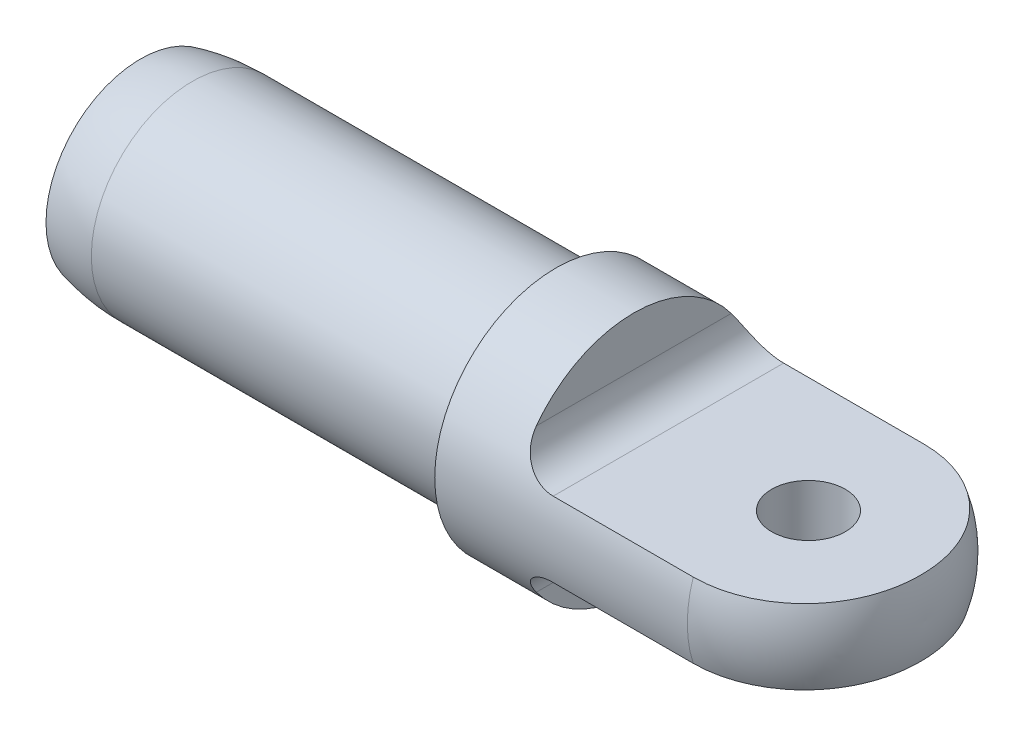
ISO-10303-21;
HEADER;
FILE_DESCRIPTION(('STEP AP214'),'2;1');
FILE_NAME('part.step','',(''),(''),'','','');
FILE_SCHEMA(('AUTOMOTIVE_DESIGN { 1 0 10303 214 1 1 1 1 }'));
ENDSEC;
DATA;
#1=APPLICATION_CONTEXT('core data for automotive mechanical design processes');
#2=APPLICATION_PROTOCOL_DEFINITION('international standard','automotive_design',2000,#1);
#3=PRODUCT_CONTEXT('',#1,'mechanical');
#4=PRODUCT('Part','Part','',(#3));
#5=PRODUCT_RELATED_PRODUCT_CATEGORY('part','',(#4));
#6=PRODUCT_DEFINITION_FORMATION('','',#4);
#7=PRODUCT_DEFINITION_CONTEXT('part definition',#1,'design');
#8=PRODUCT_DEFINITION('design','',#6,#7);
#9=PRODUCT_DEFINITION_SHAPE('','',#8);
#10=(LENGTH_UNIT() NAMED_UNIT(*) SI_UNIT(.MILLI.,.METRE.));
#11=(NAMED_UNIT(*) PLANE_ANGLE_UNIT() SI_UNIT($,.RADIAN.));
#12=(NAMED_UNIT(*) SI_UNIT($,.STERADIAN.) SOLID_ANGLE_UNIT());
#13=UNCERTAINTY_MEASURE_WITH_UNIT(LENGTH_MEASURE(1.E-05),#10,'distance_accuracy_value','');
#14=(GEOMETRIC_REPRESENTATION_CONTEXT(3) GLOBAL_UNCERTAINTY_ASSIGNED_CONTEXT((#13)) GLOBAL_UNIT_ASSIGNED_CONTEXT((#10,
#11,#12)) REPRESENTATION_CONTEXT('',''));
#15=CARTESIAN_POINT('',(0.,0.,0.));
#16=DIRECTION('',(0.,0.,1.));
#17=DIRECTION('',(1.,0.,0.));
#18=AXIS2_PLACEMENT_3D('',#15,#16,#17);
#19=CARTESIAN_POINT('',(4.11479999999999,-3.429,0.));
#20=DIRECTION('',(0.,-1.,0.));
#21=DIRECTION('',(0.,0.,-1.));
#22=AXIS2_PLACEMENT_3D('',#19,#20,#21);
#23=CYLINDRICAL_SURFACE('',#22,3.37819999999999);
#24=CARTESIAN_POINT('',(4.11479999999999,3.429,0.));
#25=DIRECTION('',(0.,-1.,0.));
#26=DIRECTION('',(0.,0.,-1.));
#27=AXIS2_PLACEMENT_3D('',#24,#25,#26);
#28=CIRCLE('',#27,3.37819999999999);
#29=CARTESIAN_POINT('',(4.11479999999999,3.429,-3.37819999999999));
#30=VERTEX_POINT('',#29);
#31=EDGE_CURVE('E19',#30,#30,#28,.T.);
#32=ORIENTED_EDGE('',*,*,#31,.F.);
#33=EDGE_LOOP('',(#32));
#34=FACE_BOUND('',#33,.T.);
#35=CARTESIAN_POINT('',(4.11479999999999,-3.429,0.));
#36=DIRECTION('',(0.,-1.,0.));
#37=DIRECTION('',(0.,0.,-1.));
#38=AXIS2_PLACEMENT_3D('',#35,#36,#37);
#39=CIRCLE('',#38,3.37819999999999);
#40=CARTESIAN_POINT('',(4.11479999999999,-3.429,-3.37819999999999));
#41=VERTEX_POINT('',#40);
#42=EDGE_CURVE('E177',#41,#41,#39,.T.);
#43=ORIENTED_EDGE('',*,*,#42,.T.);
#44=EDGE_LOOP('',(#43));
#45=FACE_BOUND('',#44,.T.);
#46=ADVANCED_FACE('F16',(#34,#45),#23,.F.);
#47=CARTESIAN_POINT('',(-17.5305929065692,0.,0.));
#48=DIRECTION('',(-1.,0.,0.));
#49=DIRECTION('',(0.,0.,1.));
#50=AXIS2_PLACEMENT_3D('',#47,#48,#49);
#51=CONICAL_SURFACE('',#50,6.34999999999985,1.17809724509603);
#52=CARTESIAN_POINT('',(-14.9003367854998,-2.88657986402541E-12,0.));
#53=VERTEX_POINT('',#52);
#54=VERTEX_LOOP('',#53);
#55=FACE_BOUND('',#54,.T.);
#56=CARTESIAN_POINT('',(-17.5305929065692,0.,0.));
#57=DIRECTION('',(1.,0.,0.));
#58=DIRECTION('',(0.,1.,0.));
#59=AXIS2_PLACEMENT_3D('',#56,#57,#58);
#60=CIRCLE('',#59,6.35);
#61=CARTESIAN_POINT('',(-17.5305929065692,6.35,0.));
#62=VERTEX_POINT('',#61);
#63=EDGE_CURVE('E102',#62,#62,#60,.F.);
#64=ORIENTED_EDGE('',*,*,#63,.T.);
#65=EDGE_LOOP('',(#64));
#66=FACE_BOUND('',#65,.T.);
#67=ADVANCED_FACE('F317',(#55,#66),#51,.F.);
#68=CARTESIAN_POINT('',(-11.90625,0.,-25.4));
#69=DIRECTION('',(-1.,0.,0.));
#70=DIRECTION('',(0.,-1.,0.));
#71=AXIS2_PLACEMENT_3D('',#68,#69,#70);
#72=PLANE('',#71);
#73=CARTESIAN_POINT('',(-11.90625,0.,0.));
#74=DIRECTION('',(-1.,0.,0.));
#75=DIRECTION('',(0.,0.,1.));
#76=AXIS2_PLACEMENT_3D('',#73,#74,#75);
#77=CIRCLE('',#76,11.1125);
#78=CARTESIAN_POINT('',(-11.90625,6.604,8.9372725285738));
#79=VERTEX_POINT('',#78);
#80=CARTESIAN_POINT('',(-11.90625,6.604,-8.93727252857381));
#81=VERTEX_POINT('',#80);
#82=EDGE_CURVE('E93',#79,#81,#77,.T.);
#83=ORIENTED_EDGE('',*,*,#82,.F.);
#84=DIRECTION('',(0.,0.,1.));
#85=VECTOR('',#84,1.);
#86=CARTESIAN_POINT('',(-11.90625,6.604,-25.4));
#87=LINE('',#86,#85);
#88=EDGE_CURVE('E82',#79,#81,#87,.F.);
#89=ORIENTED_EDGE('',*,*,#88,.T.);
#90=EDGE_LOOP('',(#83,#89));
#91=FACE_BOUND('',#90,.T.);
#92=ADVANCED_FACE('F94',(#91),#72,.F.);
#93=CARTESIAN_POINT('',(-8.73125,6.604,-25.4));
#94=DIRECTION('',(0.,0.,1.));
#95=DIRECTION('',(1.,0.,0.));
#96=AXIS2_PLACEMENT_3D('',#93,#94,#95);
#97=CYLINDRICAL_SURFACE('',#96,3.175);
#98=ORIENTED_EDGE('',*,*,#88,.F.);
#99=CARTESIAN_POINT('',(-8.73125,3.429,10.5702230463695));
#100=CARTESIAN_POINT('',(-8.81644137209209,3.42898964334418,10.57021868882));
#101=CARTESIAN_POINT('',(-8.90162878420486,3.43242866255951,10.5691105793098));
#102=CARTESIAN_POINT('',(-9.0713896064465,3.44612657704858,10.5646563075687));
#103=CARTESIAN_POINT('',(-9.15596305347103,3.45638505902536,10.5613102809678));
#104=CARTESIAN_POINT('',(-9.32379771113513,3.48362638431548,10.5523551088256));
#105=CARTESIAN_POINT('',(-9.40706039921373,3.50060099405158,10.5467487341787));
#106=CARTESIAN_POINT('',(-9.57176089589968,3.54109786752571,10.5332204817785));
#107=CARTESIAN_POINT('',(-9.65319872625449,3.56462005318909,10.5252986316354));
#108=CARTESIAN_POINT('',(-9.8939837350312,3.64474053089436,10.4979406966834));
#109=CARTESIAN_POINT('',(-10.0498768159816,3.7109049645627,10.474908439963));
#110=CARTESIAN_POINT('',(-10.3476724829089,3.86611060939245,10.4186183087708));
#111=CARTESIAN_POINT('',(-10.4895761541552,3.95515004402298,10.3853612283454));
#112=CARTESIAN_POINT('',(-10.7565227077505,4.15315582749193,10.3077777511883));
#113=CARTESIAN_POINT('',(-10.8814738286125,4.26222364591995,10.2633945480904));
#114=CARTESIAN_POINT('',(-11.110768665047,4.49561535291995,10.1633252352251));
#115=CARTESIAN_POINT('',(-11.2151178279965,4.61993519456048,10.107642121192));
#116=CARTESIAN_POINT('',(-11.4047626615352,4.88347906309568,9.98304636726048));
#117=CARTESIAN_POINT('',(-11.4893072870739,5.02306175922409,9.91375461873637));
#118=CARTESIAN_POINT('',(-11.6344640664801,5.30874166212583,9.76375698694889));
#119=CARTESIAN_POINT('',(-11.6950323763681,5.45485026464855,9.68303055633474));
#120=CARTESIAN_POINT('',(-11.7719425009657,5.68600082097612,9.54812194128914));
#121=CARTESIAN_POINT('',(-11.7961297811925,5.77051344099837,9.49730080886649));
#122=CARTESIAN_POINT('',(-11.8371428820053,5.9394662870258,9.39256419221462));
#123=CARTESIAN_POINT('',(-11.8539661502908,6.02390647782363,9.33864764245365));
#124=CARTESIAN_POINT('',(-11.8805140341432,6.19174044666473,9.22822057458625));
#125=CARTESIAN_POINT('',(-11.8902639069898,6.27513689242123,9.17172005940878));
#126=CARTESIAN_POINT('',(-11.9031297535498,6.44063808479297,9.05627192122752));
#127=CARTESIAN_POINT('',(-11.9062513840634,6.52274387344697,8.99732642870738));
#128=CARTESIAN_POINT('',(-11.90625,6.604,8.9372725285738));
#129=B_SPLINE_CURVE_WITH_KNOTS('',3,(#99,#100,#101,#102,#103,#104,#105,#106,#107,#108,#109,#110,
#111,#112,#113,#114,#115,#116,#117,#118,#119,#120,#121,#122,#123,#124,#125,#126,#127,#128),
.UNSPECIFIED.,.F.,.F.,(4,2,2,2,2,2,2,2,2,2,2,2,2,2,4),(0.,0.255490424414822,0.51096536611527,
0.766128076222038,1.0212877438465,1.53138350863043,2.04143967004604,2.55415502982541,
3.06673464010963,3.59639994424521,4.12702938859439,4.43137229256887,4.73582059570047,
5.03917636850782,5.34227314145619),.UNSPECIFIED.);
#130=CARTESIAN_POINT('',(-8.73125,3.429,10.5702230463695));
#131=VERTEX_POINT('',#130);
#132=EDGE_CURVE('E88',#131,#79,#129,.T.);
#133=ORIENTED_EDGE('',*,*,#132,.F.);
#134=DIRECTION('',(0.,0.,1.));
#135=VECTOR('',#134,1.);
#136=CARTESIAN_POINT('',(-8.73125,3.429,-25.4));
#137=LINE('',#136,#135);
#138=CARTESIAN_POINT('',(-8.73125,3.429,-10.5702230463695));
#139=VERTEX_POINT('',#138);
#140=EDGE_CURVE('E176',#139,#131,#137,.T.);
#141=ORIENTED_EDGE('',*,*,#140,.F.);
#142=CARTESIAN_POINT('',(-11.90625,6.604,-8.93727252857381));
#143=CARTESIAN_POINT('',(-11.9062534993152,6.51552669055526,-9.00266504061346));
#144=CARTESIAN_POINT('',(-11.9025509753754,6.42603559948132,-9.06674444770783));
#145=CARTESIAN_POINT('',(-11.8872535549438,6.2455714486479,-9.19197948561458));
#146=CARTESIAN_POINT('',(-11.8756510710531,6.15459704632543,-9.2531322450848));
#147=CARTESIAN_POINT('',(-11.8439614813269,5.97125559637432,-9.37250394583763));
#148=CARTESIAN_POINT('',(-11.8238157834968,5.87888326135989,-9.43069945943574));
#149=CARTESIAN_POINT('',(-11.7746168654467,5.69423737573661,-9.5433223526124));
#150=CARTESIAN_POINT('',(-11.7455662384568,5.60196380420654,-9.59775082355333));
#151=CARTESIAN_POINT('',(-11.6780054465933,5.41785778604025,-9.70287501087931));
#152=CARTESIAN_POINT('',(-11.6394344304464,5.32603221257536,-9.75354387518734));
#153=CARTESIAN_POINT('',(-11.5527437549422,5.14458073154787,-9.85045800137104));
#154=CARTESIAN_POINT('',(-11.5046253620244,5.05495453401258,-9.89670384874617));
#155=CARTESIAN_POINT('',(-11.3990054655044,4.87942431471912,-9.98441136103175));
#156=CARTESIAN_POINT('',(-11.3415363146535,4.79350870765741,-10.0258887087262));
#157=CARTESIAN_POINT('',(-11.2173025894722,4.62637437534979,-10.104099560135));
#158=CARTESIAN_POINT('',(-11.1505399759398,4.54515466443466,-10.1408340613843));
#159=CARTESIAN_POINT('',(-11.0184795516754,4.40005188404245,-10.2045353370346));
#160=CARTESIAN_POINT('',(-10.9543740569074,4.33536300343683,-10.2321460379567));
#161=CARTESIAN_POINT('',(-10.8200720295972,4.21113284581035,-10.283897286763));
#162=CARTESIAN_POINT('',(-10.7498762746489,4.15159091356822,-10.3080382766114));
#163=CARTESIAN_POINT('',(-10.6038285876853,4.03833926633514,-10.3529314172949));
#164=CARTESIAN_POINT('',(-10.5279729529392,3.98463342678959,-10.3736813208384));
#165=CARTESIAN_POINT('',(-10.3712726747603,3.88377113079372,-10.4118625671672));
#166=CARTESIAN_POINT('',(-10.2904283874196,3.83661420765825,-10.429294146454));
#167=CARTESIAN_POINT('',(-10.0553479763783,3.71318599704484,-10.474118626448));
#168=CARTESIAN_POINT('',(-9.89589888203149,3.6452431638483,-10.4977681180859));
#169=CARTESIAN_POINT('',(-9.56721506860424,3.53614552678244,-10.5350225036699));
#170=CARTESIAN_POINT('',(-9.39799448719118,3.49495302727254,-10.5486415358395));
#171=CARTESIAN_POINT('',(-9.14459357699899,3.45492537130043,-10.5617849347018));
#172=CARTESIAN_POINT('',(-9.06218681758174,3.44520437950563,-10.5649556698891));
#173=CARTESIAN_POINT('',(-8.8969489339736,3.43224643699118,-10.5691706505725));
#174=CARTESIAN_POINT('',(-8.81411874296793,3.42899873421359,-10.5702184223343));
#175=CARTESIAN_POINT('',(-8.73125,3.429,-10.5702230463695));
#176=B_SPLINE_CURVE_WITH_KNOTS('',3,(#142,#143,#144,#145,#146,#147,#148,#149,#150,#151,#152,
#153,#154,#155,#156,#157,#158,#159,#160,#161,#162,#163,#164,#165,#166,#167,#168,#169,#170,#171,
#172,#173,#174,#175),.UNSPECIFIED.,.F.,.F.,(4,2,2,2,2,2,2,2,2,2,2,2,2,2,2,2,4),(0.,
0.330032672963632,0.660382768849365,0.993036112960173,1.3255926760202,1.66033252663831,
1.99502800436371,2.32858917381233,2.66208007262952,2.94719563104933,3.23227483982451,
3.51754221272055,3.80278924661311,4.32483176453419,4.84613703272285,5.09501018993596,
5.3434696260935),.UNSPECIFIED.);
#177=EDGE_CURVE('E90',#81,#139,#176,.T.);
#178=ORIENTED_EDGE('',*,*,#177,.F.);
#179=EDGE_LOOP('',(#98,#133,#141,#178));
#180=FACE_BOUND('',#179,.T.);
#181=ADVANCED_FACE('F86',(#180),#97,.F.);
#182=CARTESIAN_POINT('',(0.,3.429,-25.4));
#183=DIRECTION('',(0.,1.,0.));
#184=DIRECTION('',(-1.,0.,0.));
#185=AXIS2_PLACEMENT_3D('',#182,#183,#184);
#186=PLANE('',#185);
#187=CARTESIAN_POINT('',(4.11479999999999,3.429,10.5702230463695));
#188=CARTESIAN_POINT('',(4.40166952508175,3.429,10.5702542728068));
#189=CARTESIAN_POINT('',(4.68853443634257,3.429,10.5581136376409));
#190=CARTESIAN_POINT('',(5.26020816392803,3.429,10.5097142509008));
#191=CARTESIAN_POINT('',(5.54501708603942,3.429,10.4734567492818));
#192=CARTESIAN_POINT('',(6.11031452463567,3.429,10.377091400848));
#193=CARTESIAN_POINT('',(6.39080660575299,3.429,10.3170044654514));
#194=CARTESIAN_POINT('',(6.9457301492514,3.429,10.1734222233246));
#195=CARTESIAN_POINT('',(7.22016168187832,3.429,10.0899271880636));
#196=CARTESIAN_POINT('',(7.76114451711752,3.429,9.90008184752718));
#197=CARTESIAN_POINT('',(8.02769212156983,3.429,9.79372100396875));
#198=CARTESIAN_POINT('',(8.55088459140192,3.429,9.55893236027575));
#199=CARTESIAN_POINT('',(8.80752944107421,3.429,9.43050452514085));
#200=CARTESIAN_POINT('',(9.30907398974534,3.429,9.15252001327218));
#201=CARTESIAN_POINT('',(9.55397489920583,3.429,9.00296552038469));
#202=CARTESIAN_POINT('',(10.0303323398181,3.429,8.6837941574126));
#203=CARTESIAN_POINT('',(10.2617889204235,3.429,8.51417736113205));
#204=CARTESIAN_POINT('',(10.7098781337536,3.429,8.1559069863756));
#205=CARTESIAN_POINT('',(10.9264944400601,3.429,7.96723298926334));
#206=CARTESIAN_POINT('',(11.3431174359032,3.429,7.57236180374972));
#207=CARTESIAN_POINT('',(11.5431241098635,3.429,7.36616459891568));
#208=CARTESIAN_POINT('',(11.9251444020348,3.429,6.93774129758939));
#209=CARTESIAN_POINT('',(12.1071586465928,3.42900000000001,6.71551575953694));
#210=CARTESIAN_POINT('',(12.4519758743128,3.429,6.25663147022035));
#211=CARTESIAN_POINT('',(12.6147788236036,3.42899999999998,6.01997269351028));
#212=CARTESIAN_POINT('',(12.9208874218734,3.42899999999998,5.53269983881803));
#213=CARTESIAN_POINT('',(13.0640906200649,3.429,5.2820214108449));
#214=CARTESIAN_POINT('',(13.3291493371821,3.42900000000001,4.7696278200104));
#215=CARTESIAN_POINT('',(13.4510048765238,3.429,4.50791266770433));
#216=CARTESIAN_POINT('',(13.6727290862934,3.429,3.97532827195377));
#217=CARTESIAN_POINT('',(13.7725972029495,3.429,3.70445879814808));
#218=CARTESIAN_POINT('',(13.9499753251063,3.429,3.15550864466398));
#219=CARTESIAN_POINT('',(14.0274853569915,3.429,2.87742797349584));
#220=CARTESIAN_POINT('',(14.1615807226585,3.429,2.30972565741935));
#221=CARTESIAN_POINT('',(14.2176610069692,3.429,2.01998493143225));
#222=CARTESIAN_POINT('',(14.3067097332198,3.429,1.43697772048884));
#223=CARTESIAN_POINT('',(14.3396768276936,3.429,1.14371103098746));
#224=CARTESIAN_POINT('',(14.3829917531008,3.429,0.555292397812699));
#225=CARTESIAN_POINT('',(14.3933217957226,3.429,0.260139154186839));
#226=CARTESIAN_POINT('',(14.391545637489,3.429,-0.330109850162345));
#227=CARTESIAN_POINT('',(14.379438245398,3.429,-0.625205607001735));
#228=CARTESIAN_POINT('',(14.3305364089263,3.429,-1.2383785737317));
#229=CARTESIAN_POINT('',(14.291750538724,3.429,-1.55630033395979));
#230=CARTESIAN_POINT('',(14.1868752224448,3.429,-2.18762750181979));
#231=CARTESIAN_POINT('',(14.120785916802,3.429,-2.50103293267266));
#232=CARTESIAN_POINT('',(13.9610676094089,3.429,-3.12049396790977));
#233=CARTESIAN_POINT('',(13.8674612431867,3.429,-3.42655539052907));
#234=CARTESIAN_POINT('',(13.6528923950862,3.429,-4.02894259233245));
#235=CARTESIAN_POINT('',(13.5319307899054,3.429,-4.32526868317194));
#236=CARTESIAN_POINT('',(13.2692474500892,3.429,-4.89277008774621));
#237=CARTESIAN_POINT('',(13.1286760473581,3.429,-5.16447826645288));
#238=CARTESIAN_POINT('',(12.8240585318938,3.429,-5.69440457333341));
#239=CARTESIAN_POINT('',(12.6600128687305,3.429,-5.95262295972926));
#240=CARTESIAN_POINT('',(12.3095921813436,3.429,-6.45350776278096));
#241=CARTESIAN_POINT('',(12.1232130652589,3.429,-6.6961713169927));
#242=CARTESIAN_POINT('',(11.7295590727545,3.429,-7.16390795191194));
#243=CARTESIAN_POINT('',(11.5222849169766,3.429,-7.38898163879535));
#244=CARTESIAN_POINT('',(11.0994387013811,3.429,-7.80879521125157));
#245=CARTESIAN_POINT('',(10.8848172516277,3.429,-8.00449372774303));
#246=CARTESIAN_POINT('',(10.4397147990793,3.429,-8.37694430050191));
#247=CARTESIAN_POINT('',(10.209233846566,3.429,-8.55369641683322));
#248=CARTESIAN_POINT('',(9.73404711601615,3.429,-8.88696292094113));
#249=CARTESIAN_POINT('',(9.48934005037075,3.429,-9.04347547268306));
#250=CARTESIAN_POINT('',(8.98749105130802,3.429,-9.33508779096158));
#251=CARTESIAN_POINT('',(8.73034946924633,3.42900000000001,-9.47018816207009));
#252=CARTESIAN_POINT('',(8.20783082998811,3.42900000000001,-9.71688014721514));
#253=CARTESIAN_POINT('',(7.94254759547565,3.429,-9.8286705493189));
#254=CARTESIAN_POINT('',(7.40348982290543,3.429,-10.0294340707516));
#255=CARTESIAN_POINT('',(7.12971555980642,3.429,-10.118407928069));
#256=CARTESIAN_POINT('',(6.57598903218075,3.429,-10.272799426286));
#257=CARTESIAN_POINT('',(6.29604511131667,3.429,-10.3382470301893));
#258=CARTESIAN_POINT('',(5.73174247171784,3.429,-10.4452479745807));
#259=CARTESIAN_POINT('',(5.44738602275004,3.429,-10.4868132071686));
#260=CARTESIAN_POINT('',(4.9877908913267,3.429,-10.5342773937649));
#261=CARTESIAN_POINT('',(4.81330149767058,3.429,-10.547765685521));
#262=CARTESIAN_POINT('',(4.46414762515507,3.429,-10.5657319579596));
#263=CARTESIAN_POINT('',(4.28948390787159,3.429,-10.5702247407097));
#264=CARTESIAN_POINT('',(4.11479999999999,3.429,-10.5702230463695));
#265=B_SPLINE_CURVE_WITH_KNOTS('',3,(#187,#188,#189,#190,#191,#192,#193,#194,#195,#196,#197,
#198,#199,#200,#201,#202,#203,#204,#205,#206,#207,#208,#209,#210,#211,#212,#213,#214,#215,#216,
#217,#218,#219,#220,#221,#222,#223,#224,#225,#226,#227,#228,#229,#230,#231,#232,#233,#234,#235,
#236,#237,#238,#239,#240,#241,#242,#243,#244,#245,#246,#247,#248,#249,#250,#251,#252,#253,#254,
#255,#256,#257,#258,#259,#260,#261,#262,#263,#264),.UNSPECIFIED.,.F.,.F.,(4,2,2,2,2,2,2,2,2,2,2,
2,2,2,2,2,2,2,2,2,2,2,2,2,2,2,2,2,2,2,2,2,2,2,2,2,2,2,4),(0.,0.8603452505255,1.72064591361902,
2.58019328815896,3.43973069473273,4.29966509324069,5.15960085569854,6.01944779221856,
6.87929156568158,7.74006658416723,8.60084240986858,9.46158825993347,10.3223356275451,
11.1874231546205,12.0525098543623,12.9176183395535,13.7827258038379,14.6671210393734,
15.5515678296086,16.4367093738281,17.3218979128328,18.2815651213669,19.2412273939589,
20.2001024471053,21.1589467739888,22.0755194033017,22.9920744811227,23.908797744625,
24.8254894023843,25.695795220284,26.5660982790584,27.4364802321846,28.3068376057372,
29.1694380160833,30.0320105225788,30.8934805327843,31.7545212059951,32.2793392882794,
32.8032930728223),.UNSPECIFIED.);
#266=CARTESIAN_POINT('',(4.11479999999999,3.429,10.5702230463695));
#267=VERTEX_POINT('',#266);
#268=CARTESIAN_POINT('',(4.11479999999999,3.429,-10.5702230463695));
#269=VERTEX_POINT('',#268);
#270=EDGE_CURVE('E170',#267,#269,#265,.T.);
#271=ORIENTED_EDGE('',*,*,#270,.T.);
#272=DIRECTION('',(-1.,0.,0.));
#273=VECTOR('',#272,1.);
#274=CARTESIAN_POINT('',(-57.15,3.429,-10.5702230463695));
#275=LINE('',#274,#273);
#276=EDGE_CURVE('E146',#139,#269,#275,.F.);
#277=ORIENTED_EDGE('',*,*,#276,.F.);
#278=ORIENTED_EDGE('',*,*,#140,.T.);
#279=DIRECTION('',(-1.,0.,0.));
#280=VECTOR('',#279,1.);
#281=CARTESIAN_POINT('',(-57.15,3.429,10.5702230463695));
#282=LINE('',#281,#280);
#283=EDGE_CURVE('E100',#267,#131,#282,.T.);
#284=ORIENTED_EDGE('',*,*,#283,.F.);
#285=EDGE_LOOP('',(#271,#277,#278,#284));
#286=FACE_BOUND('',#285,.T.);
#287=ORIENTED_EDGE('',*,*,#31,.T.);
#288=EDGE_LOOP('',(#287));
#289=FACE_BOUND('',#288,.T.);
#290=ADVANCED_FACE('F165',(#286,#289),#186,.T.);
#291=CARTESIAN_POINT('',(-11.90625,0.,-25.4));
#292=DIRECTION('',(-1.,0.,0.));
#293=DIRECTION('',(0.,-1.,0.));
#294=AXIS2_PLACEMENT_3D('',#291,#292,#293);
#295=PLANE('',#294);
#296=DIRECTION('',(0.,0.,1.));
#297=VECTOR('',#296,1.);
#298=CARTESIAN_POINT('',(-11.90625,-6.604,-25.4));
#299=LINE('',#298,#297);
#300=CARTESIAN_POINT('',(-11.90625,-6.604,-8.9372725285738));
#301=VERTEX_POINT('',#300);
#302=CARTESIAN_POINT('',(-11.90625,-6.604,8.9372725285738));
#303=VERTEX_POINT('',#302);
#304=EDGE_CURVE('E175',#301,#303,#299,.T.);
#305=ORIENTED_EDGE('',*,*,#304,.T.);
#306=CARTESIAN_POINT('',(-11.90625,0.,0.));
#307=DIRECTION('',(-1.,0.,0.));
#308=DIRECTION('',(0.,0.,1.));
#309=AXIS2_PLACEMENT_3D('',#306,#307,#308);
#310=CIRCLE('',#309,11.1125);
#311=EDGE_CURVE('E153',#301,#303,#310,.T.);
#312=ORIENTED_EDGE('',*,*,#311,.F.);
#313=EDGE_LOOP('',(#305,#312));
#314=FACE_BOUND('',#313,.T.);
#315=ADVANCED_FACE('F160',(#314),#295,.F.);
#316=CARTESIAN_POINT('',(-8.73125,-6.604,-25.4));
#317=DIRECTION('',(0.,0.,1.));
#318=DIRECTION('',(1.,0.,0.));
#319=AXIS2_PLACEMENT_3D('',#316,#317,#318);
#320=CYLINDRICAL_SURFACE('',#319,3.175);
#321=CARTESIAN_POINT('',(-11.90625,-6.604,8.9372725285738));
#322=CARTESIAN_POINT('',(-11.9062534993152,-6.51552669055526,9.00266504061346));
#323=CARTESIAN_POINT('',(-11.9025509753754,-6.42603559948132,9.06674444770782));
#324=CARTESIAN_POINT('',(-11.8872535549438,-6.2455714486479,9.19197948561458));
#325=CARTESIAN_POINT('',(-11.8756510710531,-6.15459704632543,9.2531322450848));
#326=CARTESIAN_POINT('',(-11.8439614813269,-5.97125559637432,9.37250394583762));
#327=CARTESIAN_POINT('',(-11.8238157834968,-5.87888326135989,9.43069945943573));
#328=CARTESIAN_POINT('',(-11.7746168654467,-5.69423737573661,9.54332235261239));
#329=CARTESIAN_POINT('',(-11.7455662384568,-5.60196380420654,9.59775082355333));
#330=CARTESIAN_POINT('',(-11.6780054465933,-5.41785778604025,9.70287501087931));
#331=CARTESIAN_POINT('',(-11.6394344304464,-5.32603221257536,9.75354387518733));
#332=CARTESIAN_POINT('',(-11.5527437549422,-5.14458073154787,9.85045800137103));
#333=CARTESIAN_POINT('',(-11.5046253620244,-5.05495453401259,9.89670384874617));
#334=CARTESIAN_POINT('',(-11.3990054655044,-4.87942431471912,9.98441136103175));
#335=CARTESIAN_POINT('',(-11.3415363146535,-4.79350870765741,10.0258887087262));
#336=CARTESIAN_POINT('',(-11.2173025894722,-4.62637437534979,10.104099560135));
#337=CARTESIAN_POINT('',(-11.1505399759398,-4.54515466443466,10.1408340613842));
#338=CARTESIAN_POINT('',(-11.0184795516754,-4.40005188404245,10.2045353370346));
#339=CARTESIAN_POINT('',(-10.9543740569074,-4.33536300343683,10.2321460379567));
#340=CARTESIAN_POINT('',(-10.8200720295972,-4.21113284581035,10.283897286763));
#341=CARTESIAN_POINT('',(-10.7498762746489,-4.15159091356822,10.3080382766114));
#342=CARTESIAN_POINT('',(-10.6038285876853,-4.03833926633514,10.3529314172949));
#343=CARTESIAN_POINT('',(-10.5279729529392,-3.98463342678959,10.3736813208384));
#344=CARTESIAN_POINT('',(-10.3712726747603,-3.88377113079372,10.4118625671672));
#345=CARTESIAN_POINT('',(-10.2904283874196,-3.83661420765825,10.429294146454));
#346=CARTESIAN_POINT('',(-10.0553479763783,-3.71318599704484,10.474118626448));
#347=CARTESIAN_POINT('',(-9.89589888203149,-3.6452431638483,10.4977681180859));
#348=CARTESIAN_POINT('',(-9.56721506860424,-3.53614552678245,10.5350225036699));
#349=CARTESIAN_POINT('',(-9.39799448719118,-3.49495302727254,10.5486415358395));
#350=CARTESIAN_POINT('',(-9.14459357699899,-3.45492537130043,10.5617849347018));
#351=CARTESIAN_POINT('',(-9.06218681758174,-3.44520437950564,10.5649556698891));
#352=CARTESIAN_POINT('',(-8.8969489339736,-3.43224643699118,10.5691706505725));
#353=CARTESIAN_POINT('',(-8.81411874296793,-3.42899873421359,10.5702184223342));
#354=CARTESIAN_POINT('',(-8.73125,-3.429,10.5702230463695));
#355=B_SPLINE_CURVE_WITH_KNOTS('',3,(#321,#322,#323,#324,#325,#326,#327,#328,#329,#330,#331,
#332,#333,#334,#335,#336,#337,#338,#339,#340,#341,#342,#343,#344,#345,#346,#347,#348,#349,#350,
#351,#352,#353,#354),.UNSPECIFIED.,.F.,.F.,(4,2,2,2,2,2,2,2,2,2,2,2,2,2,2,2,4),(0.,
0.330032672963634,0.660382768849367,0.993036112960175,1.32559267602021,1.66033252663831,
1.99502800436371,2.32858917381233,2.66208007262952,2.94719563104933,3.23227483982451,
3.51754221272055,3.80278924661311,4.32483176453419,4.84613703272285,5.09501018993596,
5.34346962609351),.UNSPECIFIED.);
#356=CARTESIAN_POINT('',(-8.73125,-3.429,10.5702230463695));
#357=VERTEX_POINT('',#356);
#358=EDGE_CURVE('E132',#303,#357,#355,.T.);
#359=ORIENTED_EDGE('',*,*,#358,.F.);
#360=ORIENTED_EDGE('',*,*,#304,.F.);
#361=CARTESIAN_POINT('',(-8.73125,-3.429,-10.5702230463695));
#362=CARTESIAN_POINT('',(-8.81644137209209,-3.42898964334418,-10.57021868882));
#363=CARTESIAN_POINT('',(-8.90162878420486,-3.43242866255951,-10.5691105793098));
#364=CARTESIAN_POINT('',(-9.0713896064465,-3.44612657704859,-10.5646563075687));
#365=CARTESIAN_POINT('',(-9.15596305347103,-3.45638505902536,-10.5613102809678));
#366=CARTESIAN_POINT('',(-9.32379771113513,-3.48362638431548,-10.5523551088256));
#367=CARTESIAN_POINT('',(-9.40706039921373,-3.50060099405158,-10.5467487341787));
#368=CARTESIAN_POINT('',(-9.57176089589968,-3.54109786752571,-10.5332204817785));
#369=CARTESIAN_POINT('',(-9.65319872625449,-3.5646200531891,-10.5252986316354));
#370=CARTESIAN_POINT('',(-9.8939837350312,-3.64474053089436,-10.4979406966834));
#371=CARTESIAN_POINT('',(-10.0498768159816,-3.7109049645627,-10.474908439963));
#372=CARTESIAN_POINT('',(-10.3476724829089,-3.86611060939246,-10.4186183087708));
#373=CARTESIAN_POINT('',(-10.4895761541552,-3.95515004402298,-10.3853612283454));
#374=CARTESIAN_POINT('',(-10.7565227077505,-4.15315582749193,-10.3077777511883));
#375=CARTESIAN_POINT('',(-10.8814738286125,-4.26222364591995,-10.2633945480904));
#376=CARTESIAN_POINT('',(-11.110768665047,-4.49561535291995,-10.1633252352251));
#377=CARTESIAN_POINT('',(-11.2151178279965,-4.61993519456048,-10.107642121192));
#378=CARTESIAN_POINT('',(-11.4047626615352,-4.88347906309569,-9.98304636726049));
#379=CARTESIAN_POINT('',(-11.4893072870739,-5.0230617592241,-9.91375461873637));
#380=CARTESIAN_POINT('',(-11.6344640664801,-5.30874166212584,-9.76375698694889));
#381=CARTESIAN_POINT('',(-11.6950323763681,-5.45485026464855,-9.68303055633474));
#382=CARTESIAN_POINT('',(-11.7719425009657,-5.68600082097612,-9.54812194128914));
#383=CARTESIAN_POINT('',(-11.7961297811925,-5.77051344099837,-9.4973008088665));
#384=CARTESIAN_POINT('',(-11.8371428820053,-5.9394662870258,-9.39256419221462));
#385=CARTESIAN_POINT('',(-11.8539661502908,-6.02390647782363,-9.33864764245365));
#386=CARTESIAN_POINT('',(-11.8805140341432,-6.19174044666474,-9.22822057458625));
#387=CARTESIAN_POINT('',(-11.8902639069898,-6.27513689242124,-9.17172005940878));
#388=CARTESIAN_POINT('',(-11.9031297535498,-6.44063808479297,-9.05627192122752));
#389=CARTESIAN_POINT('',(-11.9062513840634,-6.52274387344697,-8.99732642870738));
#390=CARTESIAN_POINT('',(-11.90625,-6.604,-8.9372725285738));
#391=B_SPLINE_CURVE_WITH_KNOTS('',3,(#361,#362,#363,#364,#365,#366,#367,#368,#369,#370,#371,
#372,#373,#374,#375,#376,#377,#378,#379,#380,#381,#382,#383,#384,#385,#386,#387,#388,#389,#390),
.UNSPECIFIED.,.F.,.F.,(4,2,2,2,2,2,2,2,2,2,2,2,2,2,4),(0.,0.255490424414822,0.51096536611527,
0.766128076222038,1.0212877438465,1.53138350863043,2.04143967004604,2.55415502982541,
3.06673464010963,3.59639994424521,4.12702938859439,4.43137229256887,4.73582059570047,
5.03917636850783,5.34227314145619),.UNSPECIFIED.);
#392=CARTESIAN_POINT('',(-8.73125,-3.429,-10.5702230463695));
#393=VERTEX_POINT('',#392);
#394=EDGE_CURVE('E147',#393,#301,#391,.T.);
#395=ORIENTED_EDGE('',*,*,#394,.F.);
#396=DIRECTION('',(0.,0.,1.));
#397=VECTOR('',#396,1.);
#398=CARTESIAN_POINT('',(-8.73125,-3.429,-25.4));
#399=LINE('',#398,#397);
#400=EDGE_CURVE('E188',#393,#357,#399,.T.);
#401=ORIENTED_EDGE('',*,*,#400,.T.);
#402=EDGE_LOOP('',(#359,#360,#395,#401));
#403=FACE_BOUND('',#402,.T.);
#404=ADVANCED_FACE('F155',(#403),#320,.F.);
#405=CARTESIAN_POINT('',(0.,-3.429,-25.4));
#406=DIRECTION('',(0.,1.,0.));
#407=DIRECTION('',(-1.,0.,0.));
#408=AXIS2_PLACEMENT_3D('',#405,#406,#407);
#409=PLANE('',#408);
#410=CARTESIAN_POINT('',(4.11479999999999,-3.429,10.5702230463695));
#411=CARTESIAN_POINT('',(4.40166952508175,-3.429,10.5702542728068));
#412=CARTESIAN_POINT('',(4.68853443634257,-3.429,10.5581136376409));
#413=CARTESIAN_POINT('',(5.26020816392803,-3.429,10.5097142509008));
#414=CARTESIAN_POINT('',(5.54501708603942,-3.429,10.4734567492818));
#415=CARTESIAN_POINT('',(6.11031452463567,-3.429,10.377091400848));
#416=CARTESIAN_POINT('',(6.39080660575299,-3.429,10.3170044654514));
#417=CARTESIAN_POINT('',(6.9457301492514,-3.429,10.1734222233246));
#418=CARTESIAN_POINT('',(7.22016168187832,-3.429,10.0899271880636));
#419=CARTESIAN_POINT('',(7.76114451711752,-3.429,9.90008184752718));
#420=CARTESIAN_POINT('',(8.02769212156983,-3.429,9.79372100396875));
#421=CARTESIAN_POINT('',(8.55088459140192,-3.429,9.55893236027575));
#422=CARTESIAN_POINT('',(8.80752944107421,-3.429,9.43050452514086));
#423=CARTESIAN_POINT('',(9.30907398974534,-3.429,9.15252001327218));
#424=CARTESIAN_POINT('',(9.55397489920583,-3.429,9.00296552038469));
#425=CARTESIAN_POINT('',(10.0303323398181,-3.429,8.6837941574126));
#426=CARTESIAN_POINT('',(10.2617889204235,-3.429,8.51417736113206));
#427=CARTESIAN_POINT('',(10.7098781337536,-3.429,8.1559069863756));
#428=CARTESIAN_POINT('',(10.9264944400601,-3.429,7.96723298926334));
#429=CARTESIAN_POINT('',(11.3431174359032,-3.429,7.57236180374972));
#430=CARTESIAN_POINT('',(11.5431241098635,-3.429,7.36616459891568));
#431=CARTESIAN_POINT('',(11.9251444020348,-3.429,6.93774129758939));
#432=CARTESIAN_POINT('',(12.1071586465928,-3.429,6.71551575953695));
#433=CARTESIAN_POINT('',(12.4519758743128,-3.429,6.25663147022036));
#434=CARTESIAN_POINT('',(12.6147788236036,-3.42899999999999,6.01997269351028));
#435=CARTESIAN_POINT('',(12.9208874218734,-3.42899999999999,5.53269983881803));
#436=CARTESIAN_POINT('',(13.0640906200649,-3.429,5.2820214108449));
#437=CARTESIAN_POINT('',(13.3291493371821,-3.429,4.7696278200104));
#438=CARTESIAN_POINT('',(13.4510048765238,-3.429,4.50791266770434));
#439=CARTESIAN_POINT('',(13.6727290862934,-3.429,3.97532827195377));
#440=CARTESIAN_POINT('',(13.7725972029495,-3.429,3.70445879814808));
#441=CARTESIAN_POINT('',(13.9499753251063,-3.429,3.15550864466399));
#442=CARTESIAN_POINT('',(14.0274853569915,-3.429,2.87742797349584));
#443=CARTESIAN_POINT('',(14.1615807226585,-3.429,2.30972565741935));
#444=CARTESIAN_POINT('',(14.2176610069692,-3.429,2.01998493143225));
#445=CARTESIAN_POINT('',(14.3067097332198,-3.429,1.43697772048884));
#446=CARTESIAN_POINT('',(14.3396768276936,-3.429,1.14371103098746));
#447=CARTESIAN_POINT('',(14.3829917531008,-3.429,0.555292397812701));
#448=CARTESIAN_POINT('',(14.3933217957226,-3.429,0.260139154186841));
#449=CARTESIAN_POINT('',(14.391545637489,-3.429,-0.330109850162343));
#450=CARTESIAN_POINT('',(14.379438245398,-3.429,-0.625205607001733));
#451=CARTESIAN_POINT('',(14.3305364089263,-3.429,-1.23837857373169));
#452=CARTESIAN_POINT('',(14.291750538724,-3.429,-1.55630033395979));
#453=CARTESIAN_POINT('',(14.1868752224448,-3.429,-2.18762750181979));
#454=CARTESIAN_POINT('',(14.120785916802,-3.429,-2.50103293267265));
#455=CARTESIAN_POINT('',(13.9610676094089,-3.429,-3.12049396790977));
#456=CARTESIAN_POINT('',(13.8674612431867,-3.429,-3.42655539052907));
#457=CARTESIAN_POINT('',(13.6528923950862,-3.429,-4.02894259233245));
#458=CARTESIAN_POINT('',(13.5319307899054,-3.429,-4.32526868317194));
#459=CARTESIAN_POINT('',(13.2692474500892,-3.429,-4.89277008774621));
#460=CARTESIAN_POINT('',(13.1286760473581,-3.429,-5.16447826645287));
#461=CARTESIAN_POINT('',(12.8240585318938,-3.429,-5.69440457333341));
#462=CARTESIAN_POINT('',(12.6600128687305,-3.429,-5.95262295972926));
#463=CARTESIAN_POINT('',(12.3095921813436,-3.429,-6.45350776278096));
#464=CARTESIAN_POINT('',(12.1232130652589,-3.429,-6.6961713169927));
#465=CARTESIAN_POINT('',(11.7295590727545,-3.429,-7.16390795191194));
#466=CARTESIAN_POINT('',(11.5222849169766,-3.429,-7.38898163879535));
#467=CARTESIAN_POINT('',(11.0994387013811,-3.429,-7.80879521125157));
#468=CARTESIAN_POINT('',(10.8848172516277,-3.429,-8.00449372774303));
#469=CARTESIAN_POINT('',(10.4397147990793,-3.429,-8.37694430050191));
#470=CARTESIAN_POINT('',(10.209233846566,-3.429,-8.55369641683322));
#471=CARTESIAN_POINT('',(9.73404711601615,-3.429,-8.88696292094113));
#472=CARTESIAN_POINT('',(9.48934005037075,-3.429,-9.04347547268306));
#473=CARTESIAN_POINT('',(8.98749105130802,-3.429,-9.33508779096158));
#474=CARTESIAN_POINT('',(8.73034946924633,-3.429,-9.47018816207009));
#475=CARTESIAN_POINT('',(8.20783082998811,-3.429,-9.71688014721514));
#476=CARTESIAN_POINT('',(7.94254759547565,-3.429,-9.8286705493189));
#477=CARTESIAN_POINT('',(7.40348982290544,-3.429,-10.0294340707516));
#478=CARTESIAN_POINT('',(7.12971555980642,-3.429,-10.118407928069));
#479=CARTESIAN_POINT('',(6.57598903218076,-3.429,-10.272799426286));
#480=CARTESIAN_POINT('',(6.29604511131667,-3.429,-10.3382470301893));
#481=CARTESIAN_POINT('',(5.73174247171785,-3.429,-10.4452479745807));
#482=CARTESIAN_POINT('',(5.44738602275004,-3.429,-10.4868132071686));
#483=CARTESIAN_POINT('',(4.98779089132671,-3.429,-10.5342773937649));
#484=CARTESIAN_POINT('',(4.81330149767058,-3.429,-10.547765685521));
#485=CARTESIAN_POINT('',(4.46414762515507,-3.429,-10.5657319579596));
#486=CARTESIAN_POINT('',(4.28948390787159,-3.429,-10.5702247407097));
#487=CARTESIAN_POINT('',(4.11479999999999,-3.429,-10.5702230463695));
#488=B_SPLINE_CURVE_WITH_KNOTS('',3,(#410,#411,#412,#413,#414,#415,#416,#417,#418,#419,#420,
#421,#422,#423,#424,#425,#426,#427,#428,#429,#430,#431,#432,#433,#434,#435,#436,#437,#438,#439,
#440,#441,#442,#443,#444,#445,#446,#447,#448,#449,#450,#451,#452,#453,#454,#455,#456,#457,#458,
#459,#460,#461,#462,#463,#464,#465,#466,#467,#468,#469,#470,#471,#472,#473,#474,#475,#476,#477,
#478,#479,#480,#481,#482,#483,#484,#485,#486,#487),.UNSPECIFIED.,.F.,.F.,(4,2,2,2,2,2,2,2,2,2,2,
2,2,2,2,2,2,2,2,2,2,2,2,2,2,2,2,2,2,2,2,2,2,2,2,2,2,2,4),(0.,0.8603452505255,1.72064591361902,
2.58019328815896,3.43973069473273,4.29966509324069,5.15960085569854,6.01944779221856,
6.87929156568158,7.74006658416723,8.60084240986858,9.46158825993346,10.3223356275451,
11.1874231546205,12.0525098543623,12.9176183395535,13.7827258038379,14.6671210393734,
15.5515678296086,16.4367093738281,17.3218979128328,18.2815651213669,19.2412273939589,
20.2001024471053,21.1589467739888,22.0755194033017,22.9920744811227,23.908797744625,
24.8254894023843,25.695795220284,26.5660982790584,27.4364802321846,28.3068376057372,
29.1694380160833,30.0320105225788,30.8934805327843,31.7545212059951,32.2793392882794,
32.8032930728223),.UNSPECIFIED.);
#489=CARTESIAN_POINT('',(4.11479999999999,-3.429,10.5702230463695));
#490=VERTEX_POINT('',#489);
#491=CARTESIAN_POINT('',(4.11479999999999,-3.429,-10.5702230463695));
#492=VERTEX_POINT('',#491);
#493=EDGE_CURVE('E34',#490,#492,#488,.T.);
#494=ORIENTED_EDGE('',*,*,#493,.F.);
#495=DIRECTION('',(-1.,0.,0.));
#496=VECTOR('',#495,1.);
#497=CARTESIAN_POINT('',(-57.15,-3.429,10.5702230463695));
#498=LINE('',#497,#496);
#499=EDGE_CURVE('E208',#357,#490,#498,.F.);
#500=ORIENTED_EDGE('',*,*,#499,.F.);
#501=ORIENTED_EDGE('',*,*,#400,.F.);
#502=DIRECTION('',(-1.,0.,0.));
#503=VECTOR('',#502,1.);
#504=CARTESIAN_POINT('',(-57.15,-3.429,-10.5702230463695));
#505=LINE('',#504,#503);
#506=EDGE_CURVE('E154',#492,#393,#505,.T.);
#507=ORIENTED_EDGE('',*,*,#506,.F.);
#508=EDGE_LOOP('',(#494,#500,#501,#507));
#509=FACE_BOUND('',#508,.T.);
#510=ORIENTED_EDGE('',*,*,#42,.F.);
#511=EDGE_LOOP('',(#510));
#512=FACE_BOUND('',#511,.T.);
#513=ADVANCED_FACE('F159',(#509,#512),#409,.F.);
#514=CARTESIAN_POINT('',(4.11479999999998,0.,0.396874999999999));
#515=DIRECTION('',(0.,1.,0.));
#516=DIRECTION('',(0.,0.,1.));
#517=AXIS2_PLACEMENT_3D('',#514,#515,#516);
#518=CIRCLE('',#517,10.715625);
#519=TRIMMED_CURVE('',#518,(PARAMETER_VALUE(-1.60784183660699)),
(PARAMETER_VALUE(1.60784183660699)),.T.,.PARAMETER.);
#520=CARTESIAN_POINT('',(4.11479999999998,0.,0.));
#521=DIRECTION('',(-1.,0.,0.));
#522=AXIS1_PLACEMENT('',#520,#521);
#523=SURFACE_OF_REVOLUTION('',#519,#522);
#524=CARTESIAN_POINT('',(14.8230729408154,0.,0.));
#525=VERTEX_POINT('',#524);
#526=VERTEX_LOOP('',#525);
#527=FACE_BOUND('',#526,.T.);
#528=ORIENTED_EDGE('',*,*,#493,.T.);
#529=CARTESIAN_POINT('',(4.11479999999999,0.,0.));
#530=DIRECTION('',(-1.,0.,0.));
#531=DIRECTION('',(0.,0.,1.));
#532=AXIS2_PLACEMENT_3D('',#529,#530,#531);
#533=CIRCLE('',#532,11.1125);
#534=EDGE_CURVE('E59',#269,#492,#533,.T.);
#535=ORIENTED_EDGE('',*,*,#534,.F.);
#536=ORIENTED_EDGE('',*,*,#270,.F.);
#537=CARTESIAN_POINT('',(4.11479999999999,0.,0.));
#538=DIRECTION('',(-1.,0.,0.));
#539=DIRECTION('',(0.,0.,1.));
#540=AXIS2_PLACEMENT_3D('',#537,#538,#539);
#541=CIRCLE('',#540,11.1125);
#542=EDGE_CURVE('E52',#490,#267,#541,.T.);
#543=ORIENTED_EDGE('',*,*,#542,.F.);
#544=EDGE_LOOP('',(#528,#535,#536,#543));
#545=FACE_BOUND('',#544,.T.);
#546=ADVANCED_FACE('F178',(#527,#545),#523,.F.);
#547=CARTESIAN_POINT('',(-14.9003367855,0.,0.));
#548=DIRECTION('',(1.,0.,0.));
#549=DIRECTION('',(0.,1.,0.));
#550=AXIS2_PLACEMENT_3D('',#547,#548,#549);
#551=CYLINDRICAL_SURFACE('',#550,6.35);
#552=CARTESIAN_POINT('',(-57.15,0.,0.));
#553=DIRECTION('',(1.,0.,0.));
#554=DIRECTION('',(0.,1.,0.));
#555=AXIS2_PLACEMENT_3D('',#552,#553,#554);
#556=CIRCLE('',#555,6.35);
#557=CARTESIAN_POINT('',(-57.15,6.35,0.));
#558=VERTEX_POINT('',#557);
#559=EDGE_CURVE('E204',#558,#558,#556,.F.);
#560=ORIENTED_EDGE('',*,*,#559,.T.);
#561=EDGE_LOOP('',(#560));
#562=FACE_BOUND('',#561,.T.);
#563=ORIENTED_EDGE('',*,*,#63,.F.);
#564=EDGE_LOOP('',(#563));
#565=FACE_BOUND('',#564,.T.);
#566=ADVANCED_FACE('F127',(#562,#565),#551,.F.);
#567=CARTESIAN_POINT('',(-57.15,0.,0.));
#568=DIRECTION('',(-1.,0.,0.));
#569=DIRECTION('',(0.,0.,1.));
#570=AXIS2_PLACEMENT_3D('',#567,#568,#569);
#571=CYLINDRICAL_SURFACE('',#570,11.1125);
#572=ORIENTED_EDGE('',*,*,#276,.T.);
#573=ORIENTED_EDGE('',*,*,#534,.T.);
#574=ORIENTED_EDGE('',*,*,#506,.T.);
#575=ORIENTED_EDGE('',*,*,#394,.T.);
#576=ORIENTED_EDGE('',*,*,#311,.T.);
#577=ORIENTED_EDGE('',*,*,#358,.T.);
#578=ORIENTED_EDGE('',*,*,#499,.T.);
#579=ORIENTED_EDGE('',*,*,#542,.T.);
#580=ORIENTED_EDGE('',*,*,#283,.T.);
#581=ORIENTED_EDGE('',*,*,#132,.T.);
#582=ORIENTED_EDGE('',*,*,#82,.T.);
#583=ORIENTED_EDGE('',*,*,#177,.T.);
#584=EDGE_LOOP('',(#572,#573,#574,#575,#576,#577,#578,#579,#580,#581,#582,#583));
#585=FACE_BOUND('',#584,.T.);
#586=CARTESIAN_POINT('',(-19.05,0.,0.));
#587=DIRECTION('',(-1.,0.,0.));
#588=DIRECTION('',(0.,0.,1.));
#589=AXIS2_PLACEMENT_3D('',#586,#587,#588);
#590=CIRCLE('',#589,11.1125);
#591=CARTESIAN_POINT('',(-19.05,0.,11.1125));
#592=VERTEX_POINT('',#591);
#593=EDGE_CURVE('E202',#592,#592,#590,.T.);
#594=ORIENTED_EDGE('',*,*,#593,.F.);
#595=EDGE_LOOP('',(#594));
#596=FACE_BOUND('',#595,.T.);
#597=ADVANCED_FACE('F97',(#585,#596),#571,.T.);
#598=CARTESIAN_POINT('',(-57.15,14.2875,0.));
#599=DIRECTION('',(1.,0.,0.));
#600=DIRECTION('',(0.,0.,-1.));
#601=AXIS2_PLACEMENT_3D('',#598,#599,#600);
#602=PLANE('',#601);
#603=ORIENTED_EDGE('',*,*,#559,.F.);
#604=EDGE_LOOP('',(#603));
#605=FACE_BOUND('',#604,.T.);
#606=CARTESIAN_POINT('',(-57.15,0.,0.));
#607=DIRECTION('',(-1.,0.,0.));
#608=DIRECTION('',(0.,0.,1.));
#609=AXIS2_PLACEMENT_3D('',#606,#607,#608);
#610=CIRCLE('',#609,8.66608318631283);
#611=CARTESIAN_POINT('',(-57.15,0.,8.66608318631283));
#612=VERTEX_POINT('',#611);
#613=EDGE_CURVE('E199',#612,#612,#610,.F.);
#614=ORIENTED_EDGE('',*,*,#613,.F.);
#615=EDGE_LOOP('',(#614));
#616=FACE_BOUND('',#615,.T.);
#617=ADVANCED_FACE('F126',(#605,#616),#602,.F.);
#618=CARTESIAN_POINT('',(-19.05,0.,-9.271));
#619=DIRECTION('',(-1.,0.,0.));
#620=DIRECTION('',(0.,0.,1.));
#621=AXIS2_PLACEMENT_3D('',#618,#619,#620);
#622=PLANE('',#621);
#623=ORIENTED_EDGE('',*,*,#593,.T.);
#624=EDGE_LOOP('',(#623));
#625=FACE_BOUND('',#624,.T.);
#626=CARTESIAN_POINT('',(-19.05,0.,0.));
#627=DIRECTION('',(-1.,0.,0.));
#628=DIRECTION('',(0.,0.,1.));
#629=AXIS2_PLACEMENT_3D('',#626,#627,#628);
#630=CIRCLE('',#629,9.271);
#631=CARTESIAN_POINT('',(-19.05,0.,9.271));
#632=VERTEX_POINT('',#631);
#633=EDGE_CURVE('E25',#632,#632,#630,.T.);
#634=ORIENTED_EDGE('',*,*,#633,.F.);
#635=EDGE_LOOP('',(#634));
#636=FACE_BOUND('',#635,.T.);
#637=ADVANCED_FACE('F220',(#625,#636),#622,.T.);
#638=CARTESIAN_POINT('',(-52.3875,0.,-9.77900000000001));
#639=DIRECTION('',(0.,1.,0.));
#640=DIRECTION('',(0.,0.,1.));
#641=AXIS2_PLACEMENT_3D('',#638,#639,#640);
#642=CIRCLE('',#641,19.05);
#643=TRIMMED_CURVE('',#642,(PARAMETER_VALUE(-1.0317318815494)),
(PARAMETER_VALUE(1.0317318815494)),.T.,.PARAMETER.);
#644=CARTESIAN_POINT('',(-52.3875,0.,0.));
#645=DIRECTION('',(-1.,0.,0.));
#646=AXIS1_PLACEMENT('',#644,#645);
#647=SURFACE_OF_REVOLUTION('',#643,#646);
#648=ORIENTED_EDGE('',*,*,#613,.T.);
#649=EDGE_LOOP('',(#648));
#650=FACE_BOUND('',#649,.T.);
#651=CARTESIAN_POINT('',(-52.3875,0.,0.));
#652=DIRECTION('',(-1.,0.,0.));
#653=DIRECTION('',(0.,0.,1.));
#654=AXIS2_PLACEMENT_3D('',#651,#652,#653);
#655=CIRCLE('',#654,9.271);
#656=CARTESIAN_POINT('',(-52.3875,0.,9.271));
#657=VERTEX_POINT('',#656);
#658=EDGE_CURVE('E9',#657,#657,#655,.F.);
#659=ORIENTED_EDGE('',*,*,#658,.F.);
#660=EDGE_LOOP('',(#659));
#661=FACE_BOUND('',#660,.T.);
#662=ADVANCED_FACE('F216',(#650,#661),#647,.F.);
#663=CARTESIAN_POINT('',(-57.15,0.,0.));
#664=DIRECTION('',(-1.,0.,0.));
#665=DIRECTION('',(0.,0.,1.));
#666=AXIS2_PLACEMENT_3D('',#663,#664,#665);
#667=CYLINDRICAL_SURFACE('',#666,9.271);
#668=ORIENTED_EDGE('',*,*,#658,.T.);
#669=EDGE_LOOP('',(#668));
#670=FACE_BOUND('',#669,.T.);
#671=ORIENTED_EDGE('',*,*,#633,.T.);
#672=EDGE_LOOP('',(#671));
#673=FACE_BOUND('',#672,.T.);
#674=ADVANCED_FACE('F219',(#670,#673),#667,.T.);
#675=CLOSED_SHELL('',(#46,#67,#92,#181,#290,#315,#404,#513,#546,#566,#597,#617,#637,#662,#674));
#676=MANIFOLD_SOLID_BREP('B1',#675);
#677=ADVANCED_BREP_SHAPE_REPRESENTATION('',(#18,#676),#14);
#678=SHAPE_DEFINITION_REPRESENTATION(#9,#677);
ENDSEC;
END-ISO-10303-21;
